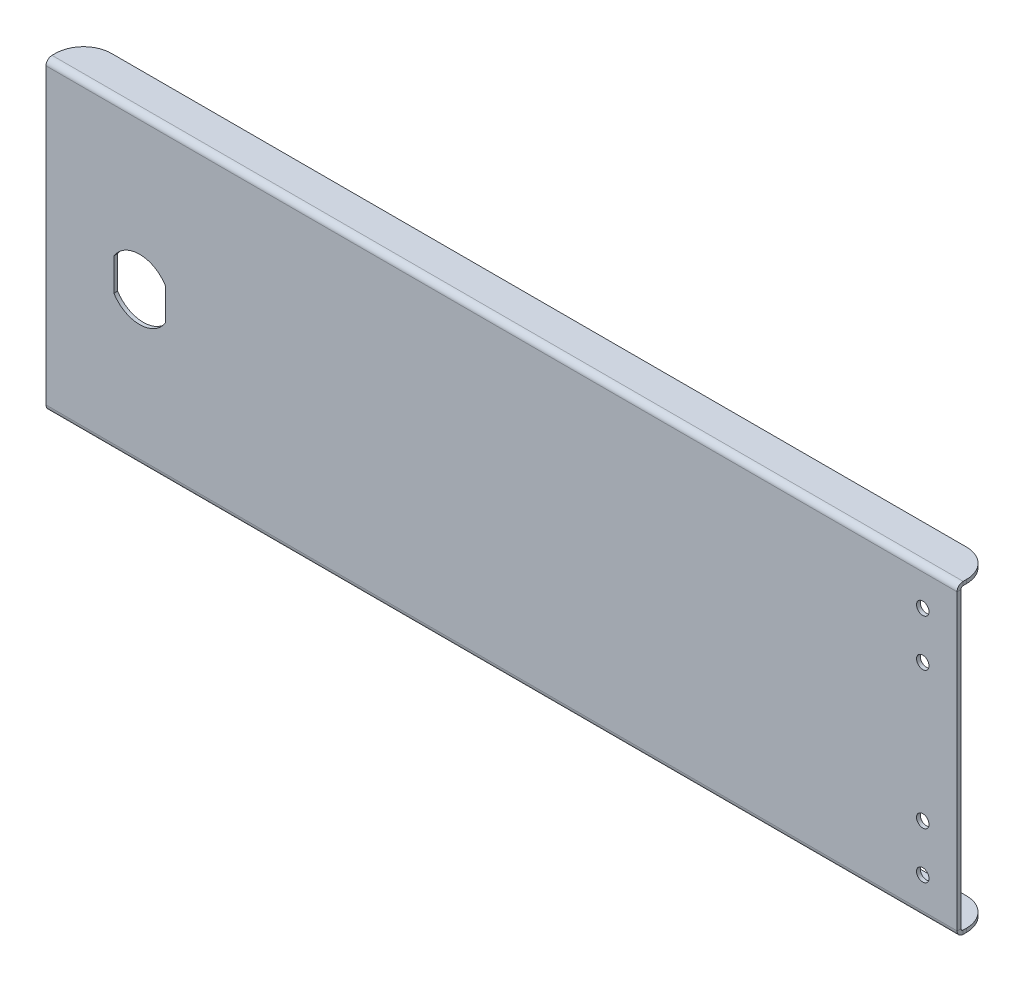
ISO-10303-21;
HEADER;
FILE_DESCRIPTION(('STEP AP214'),'2;1');
FILE_NAME('part.step','',(''),(''),'','','');
FILE_SCHEMA(('AUTOMOTIVE_DESIGN { 1 0 10303 214 1 1 1 1 }'));
ENDSEC;
DATA;
#1=APPLICATION_CONTEXT('core data for automotive mechanical design processes');
#2=APPLICATION_PROTOCOL_DEFINITION('international standard','automotive_design',2000,#1);
#3=PRODUCT_CONTEXT('',#1,'mechanical');
#4=PRODUCT('Part','Part','',(#3));
#5=PRODUCT_RELATED_PRODUCT_CATEGORY('part','',(#4));
#6=PRODUCT_DEFINITION_FORMATION('','',#4);
#7=PRODUCT_DEFINITION_CONTEXT('part definition',#1,'design');
#8=PRODUCT_DEFINITION('design','',#6,#7);
#9=PRODUCT_DEFINITION_SHAPE('','',#8);
#10=(LENGTH_UNIT() NAMED_UNIT(*) SI_UNIT(.MILLI.,.METRE.));
#11=(NAMED_UNIT(*) PLANE_ANGLE_UNIT() SI_UNIT($,.RADIAN.));
#12=(NAMED_UNIT(*) SI_UNIT($,.STERADIAN.) SOLID_ANGLE_UNIT());
#13=UNCERTAINTY_MEASURE_WITH_UNIT(LENGTH_MEASURE(1.E-05),#10,'distance_accuracy_value','');
#14=(GEOMETRIC_REPRESENTATION_CONTEXT(3) GLOBAL_UNCERTAINTY_ASSIGNED_CONTEXT((#13)) GLOBAL_UNIT_ASSIGNED_CONTEXT((#10,
#11,#12)) REPRESENTATION_CONTEXT('',''));
#15=CARTESIAN_POINT('',(0.,0.,0.));
#16=DIRECTION('',(0.,0.,1.));
#17=DIRECTION('',(1.,0.,0.));
#18=AXIS2_PLACEMENT_3D('',#15,#16,#17);
#19=CARTESIAN_POINT('',(0.,98.,3.81974001263783E-13));
#20=DIRECTION('',(0.,-1.,0.));
#21=DIRECTION('',(0.,0.,-1.));
#22=AXIS2_PLACEMENT_3D('',#19,#20,#21);
#23=PLANE('',#22);
#24=CARTESIAN_POINT('',(9.00000000000006,98.,-2.99999999999994));
#25=DIRECTION('',(0.,-1.,0.));
#26=DIRECTION('',(0.,0.,-1.));
#27=AXIS2_PLACEMENT_3D('',#24,#25,#26);
#28=CIRCLE('',#27,9.00000000000006);
#29=CARTESIAN_POINT('',(9.00000000000006,98.,-12.));
#30=VERTEX_POINT('',#29);
#31=CARTESIAN_POINT('',(0.,98.,-3.));
#32=VERTEX_POINT('',#31);
#33=EDGE_CURVE('E96',#30,#32,#28,.F.);
#34=ORIENTED_EDGE('',*,*,#33,.T.);
#35=DIRECTION('',(0.,0.,1.));
#36=VECTOR('',#35,1.);
#37=CARTESIAN_POINT('',(0.,98.,3.81974001263783E-13));
#38=LINE('',#37,#36);
#39=CARTESIAN_POINT('',(0.,98.,-1.93660000000001));
#40=VERTEX_POINT('',#39);
#41=EDGE_CURVE('E289',#32,#40,#38,.T.);
#42=ORIENTED_EDGE('',*,*,#41,.T.);
#43=DIRECTION('',(1.,0.,0.));
#44=VECTOR('',#43,1.);
#45=CARTESIAN_POINT('',(0.,98.,-1.93660000000001));
#46=LINE('',#45,#44);
#47=CARTESIAN_POINT('',(292.,98.,-1.93660000000001));
#48=VERTEX_POINT('',#47);
#49=EDGE_CURVE('E306',#48,#40,#46,.F.);
#50=ORIENTED_EDGE('',*,*,#49,.F.);
#51=DIRECTION('',(0.,0.,-1.));
#52=VECTOR('',#51,1.);
#53=CARTESIAN_POINT('',(292.,98.,3.81974001263783E-13));
#54=LINE('',#53,#52);
#55=CARTESIAN_POINT('',(292.,98.,-2.99999999999999));
#56=VERTEX_POINT('',#55);
#57=EDGE_CURVE('E295',#48,#56,#54,.T.);
#58=ORIENTED_EDGE('',*,*,#57,.T.);
#59=CARTESIAN_POINT('',(283.,98.,-2.99999999999999));
#60=DIRECTION('',(0.,-1.,0.));
#61=DIRECTION('',(0.,0.,-1.));
#62=AXIS2_PLACEMENT_3D('',#59,#60,#61);
#63=CIRCLE('',#62,9.00000000000004);
#64=CARTESIAN_POINT('',(283.,98.,-12.));
#65=VERTEX_POINT('',#64);
#66=EDGE_CURVE('E422',#56,#65,#63,.F.);
#67=ORIENTED_EDGE('',*,*,#66,.T.);
#68=DIRECTION('',(-1.,0.,0.));
#69=VECTOR('',#68,1.);
#70=CARTESIAN_POINT('',(0.,98.,-12.));
#71=LINE('',#70,#69);
#72=EDGE_CURVE('E292',#65,#30,#71,.T.);
#73=ORIENTED_EDGE('',*,*,#72,.T.);
#74=EDGE_LOOP('',(#34,#42,#50,#58,#67,#73));
#75=FACE_BOUND('',#74,.T.);
#76=ADVANCED_FACE('F79',(#75),#23,.F.);
#77=CARTESIAN_POINT('',(0.,96.8,3.77784223657171E-13));
#78=DIRECTION('',(0.,-1.,0.));
#79=DIRECTION('',(0.,0.,-1.));
#80=AXIS2_PLACEMENT_3D('',#77,#78,#79);
#81=PLANE('',#80);
#82=DIRECTION('',(0.,0.,-1.));
#83=VECTOR('',#82,1.);
#84=CARTESIAN_POINT('',(0.,96.8,-1.2));
#85=LINE('',#84,#83);
#86=CARTESIAN_POINT('',(0.,96.8,-3.00000000000001));
#87=VERTEX_POINT('',#86);
#88=CARTESIAN_POINT('',(0.,96.8,-1.93660000000001));
#89=VERTEX_POINT('',#88);
#90=EDGE_CURVE('E298',#87,#89,#85,.F.);
#91=ORIENTED_EDGE('',*,*,#90,.F.);
#92=CARTESIAN_POINT('',(9.00000000000006,96.8,-2.99999999999995));
#93=DIRECTION('',(0.,-1.,0.));
#94=DIRECTION('',(0.,0.,-1.));
#95=AXIS2_PLACEMENT_3D('',#92,#93,#94);
#96=CIRCLE('',#95,9.00000000000006);
#97=CARTESIAN_POINT('',(9.00000000000006,96.8,-12.));
#98=VERTEX_POINT('',#97);
#99=EDGE_CURVE('E440',#98,#87,#96,.F.);
#100=ORIENTED_EDGE('',*,*,#99,.F.);
#101=DIRECTION('',(1.,0.,0.));
#102=VECTOR('',#101,1.);
#103=CARTESIAN_POINT('',(0.,96.8,-12.));
#104=LINE('',#103,#102);
#105=CARTESIAN_POINT('',(283.,96.8,-12.));
#106=VERTEX_POINT('',#105);
#107=EDGE_CURVE('E300',#106,#98,#104,.F.);
#108=ORIENTED_EDGE('',*,*,#107,.F.);
#109=CARTESIAN_POINT('',(283.,96.8,-3.));
#110=DIRECTION('',(0.,-1.,0.));
#111=DIRECTION('',(0.,0.,-1.));
#112=AXIS2_PLACEMENT_3D('',#109,#110,#111);
#113=CIRCLE('',#112,9.00000000000004);
#114=CARTESIAN_POINT('',(292.,96.8,-2.99999999999999));
#115=VERTEX_POINT('',#114);
#116=EDGE_CURVE('E423',#115,#106,#113,.F.);
#117=ORIENTED_EDGE('',*,*,#116,.F.);
#118=DIRECTION('',(0.,0.,1.));
#119=VECTOR('',#118,1.);
#120=CARTESIAN_POINT('',(292.,96.8,-12.));
#121=LINE('',#120,#119);
#122=CARTESIAN_POINT('',(292.,96.8,-1.93660000000001));
#123=VERTEX_POINT('',#122);
#124=EDGE_CURVE('E303',#123,#115,#121,.F.);
#125=ORIENTED_EDGE('',*,*,#124,.F.);
#126=DIRECTION('',(1.,0.,0.));
#127=VECTOR('',#126,1.);
#128=CARTESIAN_POINT('',(0.,96.8,-1.93660000000001));
#129=LINE('',#128,#127);
#130=EDGE_CURVE('E312',#89,#123,#129,.T.);
#131=ORIENTED_EDGE('',*,*,#130,.F.);
#132=EDGE_LOOP('',(#91,#100,#108,#117,#125,#131));
#133=FACE_BOUND('',#132,.T.);
#134=ADVANCED_FACE('F489',(#133),#81,.T.);
#135=CARTESIAN_POINT('',(0.,98.,-12.));
#136=DIRECTION('',(0.,0.,1.));
#137=DIRECTION('',(0.,-1.,0.));
#138=AXIS2_PLACEMENT_3D('',#135,#136,#137);
#139=PLANE('',#138);
#140=DIRECTION('',(0.,-1.,0.));
#141=VECTOR('',#140,1.);
#142=CARTESIAN_POINT('',(9.00000000000006,96.8,-12.));
#143=LINE('',#142,#141);
#144=EDGE_CURVE('E436',#98,#30,#143,.F.);
#145=ORIENTED_EDGE('',*,*,#144,.T.);
#146=ORIENTED_EDGE('',*,*,#72,.F.);
#147=DIRECTION('',(0.,-1.,0.));
#148=VECTOR('',#147,1.);
#149=CARTESIAN_POINT('',(283.,96.8,-12.));
#150=LINE('',#149,#148);
#151=EDGE_CURVE('E268',#106,#65,#150,.F.);
#152=ORIENTED_EDGE('',*,*,#151,.F.);
#153=ORIENTED_EDGE('',*,*,#107,.T.);
#154=EDGE_LOOP('',(#145,#146,#152,#153));
#155=FACE_BOUND('',#154,.T.);
#156=ADVANCED_FACE('F494',(#155),#139,.F.);
#157=CARTESIAN_POINT('',(0.,0.,-12.));
#158=DIRECTION('',(1.,0.,0.));
#159=DIRECTION('',(0.,0.,-1.));
#160=AXIS2_PLACEMENT_3D('',#157,#158,#159);
#161=PLANE('',#160);
#162=DIRECTION('',(0.,1.,0.));
#163=VECTOR('',#162,1.);
#164=CARTESIAN_POINT('',(0.,1.19999999999998,-3.00000000000037));
#165=LINE('',#164,#163);
#166=CARTESIAN_POINT('',(0.,1.19999999999998,-3.00000000000037));
#167=VERTEX_POINT('',#166);
#168=CARTESIAN_POINT('',(0.,0.,-3.00000000000037));
#169=VERTEX_POINT('',#168);
#170=EDGE_CURVE('E429',#167,#169,#165,.F.);
#171=ORIENTED_EDGE('',*,*,#170,.T.);
#172=DIRECTION('',(0.,0.,-1.));
#173=VECTOR('',#172,1.);
#174=CARTESIAN_POINT('',(0.,0.,0.));
#175=LINE('',#174,#173);
#176=CARTESIAN_POINT('',(0.,0.,-1.93659999999999));
#177=VERTEX_POINT('',#176);
#178=EDGE_CURVE('E244',#177,#169,#175,.T.);
#179=ORIENTED_EDGE('',*,*,#178,.F.);
#180=DIRECTION('',(0.,1.,0.));
#181=VECTOR('',#180,1.);
#182=CARTESIAN_POINT('',(0.,1.2,-1.9366));
#183=LINE('',#182,#181);
#184=CARTESIAN_POINT('',(0.,1.19999999999995,-1.9366));
#185=VERTEX_POINT('',#184);
#186=EDGE_CURVE('E262',#185,#177,#183,.F.);
#187=ORIENTED_EDGE('',*,*,#186,.F.);
#188=DIRECTION('',(0.,0.,1.));
#189=VECTOR('',#188,1.);
#190=CARTESIAN_POINT('',(0.,1.19999999999996,-12.));
#191=LINE('',#190,#189);
#192=EDGE_CURVE('E257',#185,#167,#191,.F.);
#193=ORIENTED_EDGE('',*,*,#192,.T.);
#194=EDGE_LOOP('',(#171,#179,#187,#193));
#195=FACE_BOUND('',#194,.T.);
#196=ADVANCED_FACE('F474',(#195),#161,.F.);
#197=CARTESIAN_POINT('',(0.,0.,0.));
#198=DIRECTION('',(0.,1.,0.));
#199=DIRECTION('',(0.,0.,1.));
#200=AXIS2_PLACEMENT_3D('',#197,#198,#199);
#201=PLANE('',#200);
#202=CARTESIAN_POINT('',(283.,0.,-3.00000000000036));
#203=DIRECTION('',(0.,1.,0.));
#204=DIRECTION('',(0.,0.,1.));
#205=AXIS2_PLACEMENT_3D('',#202,#203,#204);
#206=CIRCLE('',#205,9.00000000000004);
#207=CARTESIAN_POINT('',(283.,0.,-12.));
#208=VERTEX_POINT('',#207);
#209=CARTESIAN_POINT('',(292.,0.,-3.00000000000036));
#210=VERTEX_POINT('',#209);
#211=EDGE_CURVE('E104',#208,#210,#206,.F.);
#212=ORIENTED_EDGE('',*,*,#211,.T.);
#213=DIRECTION('',(0.,0.,1.));
#214=VECTOR('',#213,1.);
#215=CARTESIAN_POINT('',(292.,0.,0.));
#216=LINE('',#215,#214);
#217=CARTESIAN_POINT('',(292.,0.,-1.93659999999999));
#218=VERTEX_POINT('',#217);
#219=EDGE_CURVE('E229',#210,#218,#216,.T.);
#220=ORIENTED_EDGE('',*,*,#219,.T.);
#221=DIRECTION('',(-1.,0.,0.));
#222=VECTOR('',#221,1.);
#223=CARTESIAN_POINT('',(292.,0.,-1.93659999999999));
#224=LINE('',#223,#222);
#225=EDGE_CURVE('E260',#177,#218,#224,.F.);
#226=ORIENTED_EDGE('',*,*,#225,.F.);
#227=ORIENTED_EDGE('',*,*,#178,.T.);
#228=CARTESIAN_POINT('',(9.00000000000006,0.,-3.00000000000031));
#229=DIRECTION('',(0.,1.,0.));
#230=DIRECTION('',(0.,0.,1.));
#231=AXIS2_PLACEMENT_3D('',#228,#229,#230);
#232=CIRCLE('',#231,9.00000000000006);
#233=CARTESIAN_POINT('',(9.00000000000006,0.,-12.));
#234=VERTEX_POINT('',#233);
#235=EDGE_CURVE('E432',#169,#234,#232,.F.);
#236=ORIENTED_EDGE('',*,*,#235,.T.);
#237=DIRECTION('',(1.,0.,0.));
#238=VECTOR('',#237,1.);
#239=CARTESIAN_POINT('',(0.,0.,-12.));
#240=LINE('',#239,#238);
#241=EDGE_CURVE('E233',#234,#208,#240,.T.);
#242=ORIENTED_EDGE('',*,*,#241,.T.);
#243=EDGE_LOOP('',(#212,#220,#226,#227,#236,#242));
#244=FACE_BOUND('',#243,.T.);
#245=ADVANCED_FACE('F227',(#244),#201,.F.);
#246=CARTESIAN_POINT('',(0.,1.2,0.));
#247=DIRECTION('',(0.,1.,0.));
#248=DIRECTION('',(0.,0.,1.));
#249=AXIS2_PLACEMENT_3D('',#246,#247,#248);
#250=PLANE('',#249);
#251=DIRECTION('',(0.,0.,-1.));
#252=VECTOR('',#251,1.);
#253=CARTESIAN_POINT('',(292.,1.2,-1.2));
#254=LINE('',#253,#252);
#255=CARTESIAN_POINT('',(292.,1.19999999999998,-3.00000000000037));
#256=VERTEX_POINT('',#255);
#257=CARTESIAN_POINT('',(292.,1.2,-1.9366));
#258=VERTEX_POINT('',#257);
#259=EDGE_CURVE('E252',#256,#258,#254,.F.);
#260=ORIENTED_EDGE('',*,*,#259,.F.);
#261=CARTESIAN_POINT('',(283.,1.19999999999999,-3.00000000000036));
#262=DIRECTION('',(0.,1.,0.));
#263=DIRECTION('',(0.,0.,1.));
#264=AXIS2_PLACEMENT_3D('',#261,#262,#263);
#265=CIRCLE('',#264,9.00000000000004);
#266=CARTESIAN_POINT('',(283.,1.19999999999996,-12.));
#267=VERTEX_POINT('',#266);
#268=EDGE_CURVE('E218',#267,#256,#265,.F.);
#269=ORIENTED_EDGE('',*,*,#268,.F.);
#270=DIRECTION('',(-1.,0.,0.));
#271=VECTOR('',#270,1.);
#272=CARTESIAN_POINT('',(292.,1.19999999999996,-12.));
#273=LINE('',#272,#271);
#274=CARTESIAN_POINT('',(9.00000000000006,1.19999999999996,-12.));
#275=VERTEX_POINT('',#274);
#276=EDGE_CURVE('E254',#275,#267,#273,.F.);
#277=ORIENTED_EDGE('',*,*,#276,.F.);
#278=CARTESIAN_POINT('',(9.00000000000006,1.19999999999999,-3.00000000000032));
#279=DIRECTION('',(0.,1.,0.));
#280=DIRECTION('',(0.,0.,1.));
#281=AXIS2_PLACEMENT_3D('',#278,#279,#280);
#282=CIRCLE('',#281,9.00000000000006);
#283=EDGE_CURVE('E222',#167,#275,#282,.F.);
#284=ORIENTED_EDGE('',*,*,#283,.F.);
#285=ORIENTED_EDGE('',*,*,#192,.F.);
#286=DIRECTION('',(-1.,0.,0.));
#287=VECTOR('',#286,1.);
#288=CARTESIAN_POINT('',(292.,1.2,-1.9366));
#289=LINE('',#288,#287);
#290=EDGE_CURVE('E265',#258,#185,#289,.T.);
#291=ORIENTED_EDGE('',*,*,#290,.F.);
#292=EDGE_LOOP('',(#260,#269,#277,#284,#285,#291));
#293=FACE_BOUND('',#292,.T.);
#294=ADVANCED_FACE('F449',(#293),#250,.T.);
#295=CARTESIAN_POINT('',(292.,0.,-12.));
#296=DIRECTION('',(0.,0.,1.));
#297=DIRECTION('',(0.,-1.,0.));
#298=AXIS2_PLACEMENT_3D('',#295,#296,#297);
#299=PLANE('',#298);
#300=DIRECTION('',(0.,1.,0.));
#301=VECTOR('',#300,1.);
#302=CARTESIAN_POINT('',(283.,1.19999999999996,-12.));
#303=LINE('',#302,#301);
#304=EDGE_CURVE('E223',#267,#208,#303,.F.);
#305=ORIENTED_EDGE('',*,*,#304,.T.);
#306=ORIENTED_EDGE('',*,*,#241,.F.);
#307=DIRECTION('',(0.,1.,0.));
#308=VECTOR('',#307,1.);
#309=CARTESIAN_POINT('',(9.00000000000006,1.19999999999996,-12.));
#310=LINE('',#309,#308);
#311=EDGE_CURVE('E426',#275,#234,#310,.F.);
#312=ORIENTED_EDGE('',*,*,#311,.F.);
#313=ORIENTED_EDGE('',*,*,#276,.T.);
#314=EDGE_LOOP('',(#305,#306,#312,#313));
#315=FACE_BOUND('',#314,.T.);
#316=ADVANCED_FACE('F445',(#315),#299,.F.);
#317=CARTESIAN_POINT('',(292.,98.,-12.));
#318=DIRECTION('',(-1.,0.,0.));
#319=DIRECTION('',(0.,0.,1.));
#320=AXIS2_PLACEMENT_3D('',#317,#318,#319);
#321=PLANE('',#320);
#322=DIRECTION('',(0.,-1.,0.));
#323=VECTOR('',#322,1.);
#324=CARTESIAN_POINT('',(292.,96.8,-2.99999999999999));
#325=LINE('',#324,#323);
#326=EDGE_CURVE('E247',#115,#56,#325,.F.);
#327=ORIENTED_EDGE('',*,*,#326,.T.);
#328=ORIENTED_EDGE('',*,*,#57,.F.);
#329=DIRECTION('',(0.,-1.,0.));
#330=VECTOR('',#329,1.);
#331=CARTESIAN_POINT('',(292.,96.8,-1.93660000000001));
#332=LINE('',#331,#330);
#333=EDGE_CURVE('E309',#123,#48,#332,.F.);
#334=ORIENTED_EDGE('',*,*,#333,.F.);
#335=ORIENTED_EDGE('',*,*,#124,.T.);
#336=EDGE_LOOP('',(#327,#328,#334,#335));
#337=FACE_BOUND('',#336,.T.);
#338=ADVANCED_FACE('F419',(#337),#321,.F.);
#339=CARTESIAN_POINT('',(0.,0.,-1.2));
#340=DIRECTION('',(0.,0.,-1.));
#341=DIRECTION('',(-1.,0.,0.));
#342=AXIS2_PLACEMENT_3D('',#339,#340,#341);
#343=PLANE('',#342);
#344=CARTESIAN_POINT('',(30.,49.,-1.2));
#345=DIRECTION('',(0.,0.,1.));
#346=DIRECTION('',(1.,0.,0.));
#347=AXIS2_PLACEMENT_3D('',#344,#345,#346);
#348=CIRCLE('',#347,9.75);
#349=CARTESIAN_POINT('',(38.25,54.1961524227066,-1.2));
#350=VERTEX_POINT('',#349);
#351=CARTESIAN_POINT('',(21.75,54.1961524227066,-1.2));
#352=VERTEX_POINT('',#351);
#353=EDGE_CURVE('E338',#350,#352,#348,.T.);
#354=ORIENTED_EDGE('',*,*,#353,.T.);
#355=DIRECTION('',(0.,-1.,0.));
#356=VECTOR('',#355,1.);
#357=CARTESIAN_POINT('',(21.75,54.1961524227066,-1.2));
#358=LINE('',#357,#356);
#359=CARTESIAN_POINT('',(21.75,43.8038475772934,-1.2));
#360=VERTEX_POINT('',#359);
#361=EDGE_CURVE('E341',#352,#360,#358,.T.);
#362=ORIENTED_EDGE('',*,*,#361,.T.);
#363=CARTESIAN_POINT('',(30.,49.,-1.2));
#364=DIRECTION('',(0.,0.,1.));
#365=DIRECTION('',(1.,0.,0.));
#366=AXIS2_PLACEMENT_3D('',#363,#364,#365);
#367=CIRCLE('',#366,9.75);
#368=CARTESIAN_POINT('',(38.25,43.8038475772934,-1.2));
#369=VERTEX_POINT('',#368);
#370=EDGE_CURVE('E345',#360,#369,#367,.T.);
#371=ORIENTED_EDGE('',*,*,#370,.T.);
#372=DIRECTION('',(0.,1.,0.));
#373=VECTOR('',#372,1.);
#374=CARTESIAN_POINT('',(38.25,54.1961524227066,-1.2));
#375=LINE('',#374,#373);
#376=EDGE_CURVE('E348',#369,#350,#375,.T.);
#377=ORIENTED_EDGE('',*,*,#376,.T.);
#378=EDGE_LOOP('',(#354,#362,#371,#377));
#379=FACE_BOUND('',#378,.T.);
#380=CARTESIAN_POINT('',(281.,12.,-1.2));
#381=DIRECTION('',(0.,0.,1.));
#382=DIRECTION('',(1.,0.,0.));
#383=AXIS2_PLACEMENT_3D('',#380,#381,#382);
#384=CIRCLE('',#383,2.);
#385=CARTESIAN_POINT('',(283.,12.,-1.2));
#386=VERTEX_POINT('',#385);
#387=EDGE_CURVE('E370',#386,#386,#384,.T.);
#388=ORIENTED_EDGE('',*,*,#387,.T.);
#389=EDGE_LOOP('',(#388));
#390=FACE_BOUND('',#389,.T.);
#391=CARTESIAN_POINT('',(281.,27.,-1.2));
#392=DIRECTION('',(0.,0.,1.));
#393=DIRECTION('',(1.,0.,0.));
#394=AXIS2_PLACEMENT_3D('',#391,#392,#393);
#395=CIRCLE('',#394,2.);
#396=CARTESIAN_POINT('',(283.,27.,-1.2));
#397=VERTEX_POINT('',#396);
#398=EDGE_CURVE('E376',#397,#397,#395,.T.);
#399=ORIENTED_EDGE('',*,*,#398,.T.);
#400=EDGE_LOOP('',(#399));
#401=FACE_BOUND('',#400,.T.);
#402=CARTESIAN_POINT('',(281.,71.,-1.2));
#403=DIRECTION('',(0.,0.,1.));
#404=DIRECTION('',(1.,0.,0.));
#405=AXIS2_PLACEMENT_3D('',#402,#403,#404);
#406=CIRCLE('',#405,2.);
#407=CARTESIAN_POINT('',(283.,71.,-1.2));
#408=VERTEX_POINT('',#407);
#409=EDGE_CURVE('E382',#408,#408,#406,.T.);
#410=ORIENTED_EDGE('',*,*,#409,.T.);
#411=EDGE_LOOP('',(#410));
#412=FACE_BOUND('',#411,.T.);
#413=CARTESIAN_POINT('',(281.,86.,-1.2));
#414=DIRECTION('',(0.,0.,1.));
#415=DIRECTION('',(1.,0.,0.));
#416=AXIS2_PLACEMENT_3D('',#413,#414,#415);
#417=CIRCLE('',#416,2.);
#418=CARTESIAN_POINT('',(283.,86.,-1.2));
#419=VERTEX_POINT('',#418);
#420=EDGE_CURVE('E388',#419,#419,#417,.T.);
#421=ORIENTED_EDGE('',*,*,#420,.T.);
#422=EDGE_LOOP('',(#421));
#423=FACE_BOUND('',#422,.T.);
#424=DIRECTION('',(0.,1.,0.));
#425=VECTOR('',#424,1.);
#426=CARTESIAN_POINT('',(292.,0.,-1.2));
#427=LINE('',#426,#425);
#428=CARTESIAN_POINT('',(292.,1.93660000000004,-1.19999999999998));
#429=VERTEX_POINT('',#428);
#430=CARTESIAN_POINT('',(292.,96.0634,-1.2));
#431=VERTEX_POINT('',#430);
#432=EDGE_CURVE('E13',#429,#431,#427,.T.);
#433=ORIENTED_EDGE('',*,*,#432,.F.);
#434=DIRECTION('',(-1.,0.,0.));
#435=VECTOR('',#434,1.);
#436=CARTESIAN_POINT('',(0.,1.9366,-1.19999999999998));
#437=LINE('',#436,#435);
#438=CARTESIAN_POINT('',(0.,1.9366,-1.19999999999998));
#439=VERTEX_POINT('',#438);
#440=EDGE_CURVE('E242',#439,#429,#437,.F.);
#441=ORIENTED_EDGE('',*,*,#440,.F.);
#442=DIRECTION('',(0.,-1.,0.));
#443=VECTOR('',#442,1.);
#444=CARTESIAN_POINT('',(0.,0.,-1.2));
#445=LINE('',#444,#443);
#446=CARTESIAN_POINT('',(0.,96.0634,-1.2));
#447=VERTEX_POINT('',#446);
#448=EDGE_CURVE('E88',#447,#439,#445,.T.);
#449=ORIENTED_EDGE('',*,*,#448,.F.);
#450=DIRECTION('',(1.,0.,0.));
#451=VECTOR('',#450,1.);
#452=CARTESIAN_POINT('',(292.,96.0634,-1.20000000000001));
#453=LINE('',#452,#451);
#454=EDGE_CURVE('E328',#431,#447,#453,.F.);
#455=ORIENTED_EDGE('',*,*,#454,.F.);
#456=EDGE_LOOP('',(#433,#441,#449,#455));
#457=FACE_BOUND('',#456,.T.);
#458=ADVANCED_FACE('F463',(#379,#390,#401,#412,#423,#457),#343,.T.);
#459=CARTESIAN_POINT('',(0.,0.,0.));
#460=DIRECTION('',(0.,0.,-1.));
#461=DIRECTION('',(-1.,0.,0.));
#462=AXIS2_PLACEMENT_3D('',#459,#460,#461);
#463=PLANE('',#462);
#464=DIRECTION('',(0.,-1.,0.));
#465=VECTOR('',#464,1.);
#466=CARTESIAN_POINT('',(21.75,54.1961524227066,0.));
#467=LINE('',#466,#465);
#468=CARTESIAN_POINT('',(21.75,54.1961524227066,0.));
#469=VERTEX_POINT('',#468);
#470=CARTESIAN_POINT('',(21.75,43.8038475772934,0.));
#471=VERTEX_POINT('',#470);
#472=EDGE_CURVE('E353',#469,#471,#467,.T.);
#473=ORIENTED_EDGE('',*,*,#472,.F.);
#474=CARTESIAN_POINT('',(30.,49.,0.));
#475=DIRECTION('',(0.,0.,1.));
#476=DIRECTION('',(1.,0.,0.));
#477=AXIS2_PLACEMENT_3D('',#474,#475,#476);
#478=CIRCLE('',#477,9.75);
#479=CARTESIAN_POINT('',(38.25,54.1961524227066,0.));
#480=VERTEX_POINT('',#479);
#481=EDGE_CURVE('E336',#480,#469,#478,.T.);
#482=ORIENTED_EDGE('',*,*,#481,.F.);
#483=DIRECTION('',(0.,1.,0.));
#484=VECTOR('',#483,1.);
#485=CARTESIAN_POINT('',(38.25,54.1961524227066,0.));
#486=LINE('',#485,#484);
#487=CARTESIAN_POINT('',(38.25,43.8038475772934,0.));
#488=VERTEX_POINT('',#487);
#489=EDGE_CURVE('E342',#488,#480,#486,.T.);
#490=ORIENTED_EDGE('',*,*,#489,.F.);
#491=CARTESIAN_POINT('',(30.,49.,0.));
#492=DIRECTION('',(0.,0.,1.));
#493=DIRECTION('',(1.,0.,0.));
#494=AXIS2_PLACEMENT_3D('',#491,#492,#493);
#495=CIRCLE('',#494,9.75);
#496=EDGE_CURVE('E356',#471,#488,#495,.T.);
#497=ORIENTED_EDGE('',*,*,#496,.F.);
#498=EDGE_LOOP('',(#473,#482,#490,#497));
#499=FACE_BOUND('',#498,.T.);
#500=CARTESIAN_POINT('',(281.,12.,0.));
#501=DIRECTION('',(0.,0.,1.));
#502=DIRECTION('',(1.,0.,0.));
#503=AXIS2_PLACEMENT_3D('',#500,#501,#502);
#504=CIRCLE('',#503,2.);
#505=CARTESIAN_POINT('',(283.,12.,0.));
#506=VERTEX_POINT('',#505);
#507=EDGE_CURVE('E363',#506,#506,#504,.T.);
#508=ORIENTED_EDGE('',*,*,#507,.F.);
#509=EDGE_LOOP('',(#508));
#510=FACE_BOUND('',#509,.T.);
#511=CARTESIAN_POINT('',(281.,27.,0.));
#512=DIRECTION('',(0.,0.,1.));
#513=DIRECTION('',(1.,0.,0.));
#514=AXIS2_PLACEMENT_3D('',#511,#512,#513);
#515=CIRCLE('',#514,2.);
#516=CARTESIAN_POINT('',(283.,27.,0.));
#517=VERTEX_POINT('',#516);
#518=EDGE_CURVE('E373',#517,#517,#515,.T.);
#519=ORIENTED_EDGE('',*,*,#518,.F.);
#520=EDGE_LOOP('',(#519));
#521=FACE_BOUND('',#520,.T.);
#522=CARTESIAN_POINT('',(281.,71.,0.));
#523=DIRECTION('',(0.,0.,1.));
#524=DIRECTION('',(1.,0.,0.));
#525=AXIS2_PLACEMENT_3D('',#522,#523,#524);
#526=CIRCLE('',#525,2.);
#527=CARTESIAN_POINT('',(283.,71.,0.));
#528=VERTEX_POINT('',#527);
#529=EDGE_CURVE('E379',#528,#528,#526,.T.);
#530=ORIENTED_EDGE('',*,*,#529,.F.);
#531=EDGE_LOOP('',(#530));
#532=FACE_BOUND('',#531,.T.);
#533=CARTESIAN_POINT('',(281.,86.,0.));
#534=DIRECTION('',(0.,0.,1.));
#535=DIRECTION('',(1.,0.,0.));
#536=AXIS2_PLACEMENT_3D('',#533,#534,#535);
#537=CIRCLE('',#536,2.);
#538=CARTESIAN_POINT('',(283.,86.,0.));
#539=VERTEX_POINT('',#538);
#540=EDGE_CURVE('E385',#539,#539,#537,.T.);
#541=ORIENTED_EDGE('',*,*,#540,.F.);
#542=EDGE_LOOP('',(#541));
#543=FACE_BOUND('',#542,.T.);
#544=DIRECTION('',(-1.,0.,0.));
#545=VECTOR('',#544,1.);
#546=CARTESIAN_POINT('',(0.,1.93660000000003,0.));
#547=LINE('',#546,#545);
#548=CARTESIAN_POINT('',(0.,1.93660000000003,0.));
#549=VERTEX_POINT('',#548);
#550=CARTESIAN_POINT('',(292.,1.93660000000004,0.));
#551=VERTEX_POINT('',#550);
#552=EDGE_CURVE('E269',#549,#551,#547,.F.);
#553=ORIENTED_EDGE('',*,*,#552,.T.);
#554=DIRECTION('',(0.,1.,0.));
#555=VECTOR('',#554,1.);
#556=CARTESIAN_POINT('',(292.,0.,0.));
#557=LINE('',#556,#555);
#558=CARTESIAN_POINT('',(292.,96.0634,0.));
#559=VERTEX_POINT('',#558);
#560=EDGE_CURVE('E83',#551,#559,#557,.T.);
#561=ORIENTED_EDGE('',*,*,#560,.T.);
#562=DIRECTION('',(1.,0.,0.));
#563=VECTOR('',#562,1.);
#564=CARTESIAN_POINT('',(292.,96.0634,0.));
#565=LINE('',#564,#563);
#566=CARTESIAN_POINT('',(0.,96.0634,0.));
#567=VERTEX_POINT('',#566);
#568=EDGE_CURVE('E316',#559,#567,#565,.F.);
#569=ORIENTED_EDGE('',*,*,#568,.T.);
#570=DIRECTION('',(0.,-1.,0.));
#571=VECTOR('',#570,1.);
#572=CARTESIAN_POINT('',(0.,0.,0.));
#573=LINE('',#572,#571);
#574=EDGE_CURVE('E391',#567,#549,#573,.T.);
#575=ORIENTED_EDGE('',*,*,#574,.T.);
#576=EDGE_LOOP('',(#553,#561,#569,#575));
#577=FACE_BOUND('',#576,.T.);
#578=ADVANCED_FACE('F400',(#499,#510,#521,#532,#543,#577),#463,.F.);
#579=CARTESIAN_POINT('',(0.,0.,-1.2));
#580=DIRECTION('',(-1.,0.,0.));
#581=DIRECTION('',(0.,0.,1.));
#582=AXIS2_PLACEMENT_3D('',#579,#580,#581);
#583=PLANE('',#582);
#584=ORIENTED_EDGE('',*,*,#448,.T.);
#585=DIRECTION('',(0.,0.,1.));
#586=VECTOR('',#585,1.);
#587=CARTESIAN_POINT('',(0.,1.9366,-1.19999999999998));
#588=LINE('',#587,#586);
#589=EDGE_CURVE('E275',#439,#549,#588,.T.);
#590=ORIENTED_EDGE('',*,*,#589,.T.);
#591=ORIENTED_EDGE('',*,*,#574,.F.);
#592=DIRECTION('',(0.,0.,1.));
#593=VECTOR('',#592,1.);
#594=CARTESIAN_POINT('',(0.,96.0634,-1.20000000000001));
#595=LINE('',#594,#593);
#596=EDGE_CURVE('E333',#447,#567,#595,.T.);
#597=ORIENTED_EDGE('',*,*,#596,.F.);
#598=EDGE_LOOP('',(#584,#590,#591,#597));
#599=FACE_BOUND('',#598,.T.);
#600=ADVANCED_FACE('F81',(#599),#583,.T.);
#601=CARTESIAN_POINT('',(292.,0.,-1.2));
#602=DIRECTION('',(1.,0.,0.));
#603=DIRECTION('',(0.,0.,-1.));
#604=AXIS2_PLACEMENT_3D('',#601,#602,#603);
#605=PLANE('',#604);
#606=DIRECTION('',(0.,0.,1.));
#607=VECTOR('',#606,1.);
#608=CARTESIAN_POINT('',(292.,1.93660000000004,-1.19999999999998));
#609=LINE('',#608,#607);
#610=EDGE_CURVE('E283',#429,#551,#609,.T.);
#611=ORIENTED_EDGE('',*,*,#610,.F.);
#612=ORIENTED_EDGE('',*,*,#432,.T.);
#613=DIRECTION('',(0.,0.,1.));
#614=VECTOR('',#613,1.);
#615=CARTESIAN_POINT('',(292.,96.0634,-1.20000000000001));
#616=LINE('',#615,#614);
#617=EDGE_CURVE('E322',#431,#559,#616,.T.);
#618=ORIENTED_EDGE('',*,*,#617,.T.);
#619=ORIENTED_EDGE('',*,*,#560,.F.);
#620=EDGE_LOOP('',(#611,#612,#618,#619));
#621=FACE_BOUND('',#620,.T.);
#622=ADVANCED_FACE('F552',(#621),#605,.T.);
#623=CARTESIAN_POINT('',(281.,86.,-1.2));
#624=DIRECTION('',(0.,0.,1.));
#625=DIRECTION('',(1.,0.,0.));
#626=AXIS2_PLACEMENT_3D('',#623,#624,#625);
#627=CYLINDRICAL_SURFACE('',#626,2.);
#628=ORIENTED_EDGE('',*,*,#420,.F.);
#629=EDGE_LOOP('',(#628));
#630=FACE_BOUND('',#629,.T.);
#631=ORIENTED_EDGE('',*,*,#540,.T.);
#632=EDGE_LOOP('',(#631));
#633=FACE_BOUND('',#632,.T.);
#634=ADVANCED_FACE('F548',(#630,#633),#627,.F.);
#635=CARTESIAN_POINT('',(281.,71.,-1.2));
#636=DIRECTION('',(0.,0.,1.));
#637=DIRECTION('',(1.,0.,0.));
#638=AXIS2_PLACEMENT_3D('',#635,#636,#637);
#639=CYLINDRICAL_SURFACE('',#638,2.);
#640=ORIENTED_EDGE('',*,*,#409,.F.);
#641=EDGE_LOOP('',(#640));
#642=FACE_BOUND('',#641,.T.);
#643=ORIENTED_EDGE('',*,*,#529,.T.);
#644=EDGE_LOOP('',(#643));
#645=FACE_BOUND('',#644,.T.);
#646=ADVANCED_FACE('F544',(#642,#645),#639,.F.);
#647=CARTESIAN_POINT('',(281.,27.,-1.2));
#648=DIRECTION('',(0.,0.,1.));
#649=DIRECTION('',(1.,0.,0.));
#650=AXIS2_PLACEMENT_3D('',#647,#648,#649);
#651=CYLINDRICAL_SURFACE('',#650,2.);
#652=ORIENTED_EDGE('',*,*,#398,.F.);
#653=EDGE_LOOP('',(#652));
#654=FACE_BOUND('',#653,.T.);
#655=ORIENTED_EDGE('',*,*,#518,.T.);
#656=EDGE_LOOP('',(#655));
#657=FACE_BOUND('',#656,.T.);
#658=ADVANCED_FACE('F540',(#654,#657),#651,.F.);
#659=CARTESIAN_POINT('',(281.,12.,-1.2));
#660=DIRECTION('',(0.,0.,1.));
#661=DIRECTION('',(1.,0.,0.));
#662=AXIS2_PLACEMENT_3D('',#659,#660,#661);
#663=CYLINDRICAL_SURFACE('',#662,2.);
#664=ORIENTED_EDGE('',*,*,#387,.F.);
#665=EDGE_LOOP('',(#664));
#666=FACE_BOUND('',#665,.T.);
#667=ORIENTED_EDGE('',*,*,#507,.T.);
#668=EDGE_LOOP('',(#667));
#669=FACE_BOUND('',#668,.T.);
#670=ADVANCED_FACE('F536',(#666,#669),#663,.F.);
#671=CARTESIAN_POINT('',(30.,49.,-1.2));
#672=DIRECTION('',(0.,0.,1.));
#673=DIRECTION('',(1.,0.,0.));
#674=AXIS2_PLACEMENT_3D('',#671,#672,#673);
#675=CYLINDRICAL_SURFACE('',#674,9.75);
#676=ORIENTED_EDGE('',*,*,#481,.T.);
#677=DIRECTION('',(0.,0.,1.));
#678=VECTOR('',#677,1.);
#679=CARTESIAN_POINT('',(21.75,54.1961524227066,-1.2));
#680=LINE('',#679,#678);
#681=EDGE_CURVE('E351',#352,#469,#680,.T.);
#682=ORIENTED_EDGE('',*,*,#681,.F.);
#683=ORIENTED_EDGE('',*,*,#353,.F.);
#684=DIRECTION('',(0.,0.,1.));
#685=VECTOR('',#684,1.);
#686=CARTESIAN_POINT('',(38.25,54.1961524227066,-1.2));
#687=LINE('',#686,#685);
#688=EDGE_CURVE('E361',#350,#480,#687,.T.);
#689=ORIENTED_EDGE('',*,*,#688,.T.);
#690=EDGE_LOOP('',(#676,#682,#683,#689));
#691=FACE_BOUND('',#690,.T.);
#692=ADVANCED_FACE('F526',(#691),#675,.F.);
#693=CARTESIAN_POINT('',(38.25,54.1961524227066,-1.2));
#694=DIRECTION('',(1.,0.,0.));
#695=DIRECTION('',(0.,0.,-1.));
#696=AXIS2_PLACEMENT_3D('',#693,#694,#695);
#697=PLANE('',#696);
#698=ORIENTED_EDGE('',*,*,#489,.T.);
#699=ORIENTED_EDGE('',*,*,#688,.F.);
#700=ORIENTED_EDGE('',*,*,#376,.F.);
#701=DIRECTION('',(0.,0.,1.));
#702=VECTOR('',#701,1.);
#703=CARTESIAN_POINT('',(38.25,43.8038475772934,-1.2));
#704=LINE('',#703,#702);
#705=EDGE_CURVE('E364',#369,#488,#704,.T.);
#706=ORIENTED_EDGE('',*,*,#705,.T.);
#707=EDGE_LOOP('',(#698,#699,#700,#706));
#708=FACE_BOUND('',#707,.T.);
#709=ADVANCED_FACE('F522',(#708),#697,.F.);
#710=CARTESIAN_POINT('',(30.,49.,-1.2));
#711=DIRECTION('',(0.,0.,1.));
#712=DIRECTION('',(1.,0.,0.));
#713=AXIS2_PLACEMENT_3D('',#710,#711,#712);
#714=CYLINDRICAL_SURFACE('',#713,9.75);
#715=ORIENTED_EDGE('',*,*,#496,.T.);
#716=ORIENTED_EDGE('',*,*,#705,.F.);
#717=ORIENTED_EDGE('',*,*,#370,.F.);
#718=DIRECTION('',(0.,0.,1.));
#719=VECTOR('',#718,1.);
#720=CARTESIAN_POINT('',(21.75,43.8038475772934,-1.2));
#721=LINE('',#720,#719);
#722=EDGE_CURVE('E366',#360,#471,#721,.T.);
#723=ORIENTED_EDGE('',*,*,#722,.T.);
#724=EDGE_LOOP('',(#715,#716,#717,#723));
#725=FACE_BOUND('',#724,.T.);
#726=ADVANCED_FACE('F525',(#725),#714,.F.);
#727=CARTESIAN_POINT('',(21.75,54.1961524227066,-1.2));
#728=DIRECTION('',(-1.,0.,0.));
#729=DIRECTION('',(0.,0.,1.));
#730=AXIS2_PLACEMENT_3D('',#727,#728,#729);
#731=PLANE('',#730);
#732=ORIENTED_EDGE('',*,*,#472,.T.);
#733=ORIENTED_EDGE('',*,*,#722,.F.);
#734=ORIENTED_EDGE('',*,*,#361,.F.);
#735=ORIENTED_EDGE('',*,*,#681,.T.);
#736=EDGE_LOOP('',(#732,#733,#734,#735));
#737=FACE_BOUND('',#736,.T.);
#738=ADVANCED_FACE('F518',(#737),#731,.F.);
#739=CARTESIAN_POINT('',(0.,96.0634,-1.93660000000001));
#740=DIRECTION('',(-1.,0.,0.));
#741=DIRECTION('',(0.,0.,1.));
#742=AXIS2_PLACEMENT_3D('',#739,#740,#741);
#743=PLANE('',#742);
#744=DIRECTION('',(0.,-1.,0.));
#745=VECTOR('',#744,1.);
#746=CARTESIAN_POINT('',(0.,98.,-1.93660000000001));
#747=LINE('',#746,#745);
#748=EDGE_CURVE('E286',#89,#40,#747,.F.);
#749=ORIENTED_EDGE('',*,*,#748,.F.);
#750=CARTESIAN_POINT('',(0.,96.0634,-1.93660000000001));
#751=DIRECTION('',(1.,0.,0.));
#752=DIRECTION('',(0.,0.,-1.));
#753=AXIS2_PLACEMENT_3D('',#750,#751,#752);
#754=CIRCLE('',#753,0.736600000000004);
#755=EDGE_CURVE('E325',#447,#89,#754,.F.);
#756=ORIENTED_EDGE('',*,*,#755,.F.);
#757=ORIENTED_EDGE('',*,*,#596,.T.);
#758=CARTESIAN_POINT('',(0.,96.0634,-1.93660000000001));
#759=DIRECTION('',(1.,0.,0.));
#760=DIRECTION('',(0.,0.,-1.));
#761=AXIS2_PLACEMENT_3D('',#758,#759,#760);
#762=CIRCLE('',#761,1.9366);
#763=EDGE_CURVE('E318',#567,#40,#762,.F.);
#764=ORIENTED_EDGE('',*,*,#763,.T.);
#765=EDGE_LOOP('',(#749,#756,#757,#764));
#766=FACE_BOUND('',#765,.T.);
#767=ADVANCED_FACE('F515',(#766),#743,.T.);
#768=CARTESIAN_POINT('',(292.,96.0634,-1.93660000000001));
#769=DIRECTION('',(-1.,0.,0.));
#770=DIRECTION('',(0.,0.,1.));
#771=AXIS2_PLACEMENT_3D('',#768,#769,#770);
#772=PLANE('',#771);
#773=CARTESIAN_POINT('',(292.,96.0634,-1.93660000000001));
#774=DIRECTION('',(1.,0.,0.));
#775=DIRECTION('',(0.,0.,-1.));
#776=AXIS2_PLACEMENT_3D('',#773,#774,#775);
#777=CIRCLE('',#776,0.736600000000004);
#778=EDGE_CURVE('E291',#123,#431,#777,.T.);
#779=ORIENTED_EDGE('',*,*,#778,.F.);
#780=ORIENTED_EDGE('',*,*,#333,.T.);
#781=CARTESIAN_POINT('',(292.,96.0634,-1.93660000000001));
#782=DIRECTION('',(1.,0.,0.));
#783=DIRECTION('',(0.,0.,-1.));
#784=AXIS2_PLACEMENT_3D('',#781,#782,#783);
#785=CIRCLE('',#784,1.9366);
#786=EDGE_CURVE('E319',#48,#559,#785,.T.);
#787=ORIENTED_EDGE('',*,*,#786,.T.);
#788=ORIENTED_EDGE('',*,*,#617,.F.);
#789=EDGE_LOOP('',(#779,#780,#787,#788));
#790=FACE_BOUND('',#789,.T.);
#791=ADVANCED_FACE('F409',(#790),#772,.F.);
#792=CARTESIAN_POINT('',(292.,96.0634,-1.93660000000001));
#793=DIRECTION('',(1.,0.,0.));
#794=DIRECTION('',(0.,1.,0.));
#795=AXIS2_PLACEMENT_3D('',#792,#793,#794);
#796=CYLINDRICAL_SURFACE('',#795,1.9366);
#797=ORIENTED_EDGE('',*,*,#568,.F.);
#798=ORIENTED_EDGE('',*,*,#786,.F.);
#799=ORIENTED_EDGE('',*,*,#49,.T.);
#800=ORIENTED_EDGE('',*,*,#763,.F.);
#801=EDGE_LOOP('',(#797,#798,#799,#800));
#802=FACE_BOUND('',#801,.T.);
#803=ADVANCED_FACE('F405',(#802),#796,.T.);
#804=CARTESIAN_POINT('',(292.,96.0634,-1.93660000000001));
#805=DIRECTION('',(1.,0.,0.));
#806=DIRECTION('',(0.,1.,0.));
#807=AXIS2_PLACEMENT_3D('',#804,#805,#806);
#808=CYLINDRICAL_SURFACE('',#807,0.736600000000004);
#809=ORIENTED_EDGE('',*,*,#454,.T.);
#810=ORIENTED_EDGE('',*,*,#755,.T.);
#811=ORIENTED_EDGE('',*,*,#130,.T.);
#812=ORIENTED_EDGE('',*,*,#778,.T.);
#813=EDGE_LOOP('',(#809,#810,#811,#812));
#814=FACE_BOUND('',#813,.T.);
#815=ADVANCED_FACE('F503',(#814),#808,.F.);
#816=CARTESIAN_POINT('',(0.,98.,-1.2));
#817=DIRECTION('',(1.,0.,0.));
#818=DIRECTION('',(0.,0.,-1.));
#819=AXIS2_PLACEMENT_3D('',#816,#817,#818);
#820=PLANE('',#819);
#821=ORIENTED_EDGE('',*,*,#41,.F.);
#822=DIRECTION('',(0.,-1.,0.));
#823=VECTOR('',#822,1.);
#824=CARTESIAN_POINT('',(0.,96.8,-3.00000000000001));
#825=LINE('',#824,#823);
#826=EDGE_CURVE('E438',#87,#32,#825,.F.);
#827=ORIENTED_EDGE('',*,*,#826,.F.);
#828=ORIENTED_EDGE('',*,*,#90,.T.);
#829=ORIENTED_EDGE('',*,*,#748,.T.);
#830=EDGE_LOOP('',(#821,#827,#828,#829));
#831=FACE_BOUND('',#830,.T.);
#832=ADVANCED_FACE('F500',(#831),#820,.F.);
#833=CARTESIAN_POINT('',(292.,1.93660000000002,-1.9366));
#834=DIRECTION('',(1.,0.,0.));
#835=DIRECTION('',(0.,1.,0.));
#836=AXIS2_PLACEMENT_3D('',#833,#834,#835);
#837=PLANE('',#836);
#838=DIRECTION('',(0.,1.,0.));
#839=VECTOR('',#838,1.);
#840=CARTESIAN_POINT('',(292.,0.,-1.93659999999999));
#841=LINE('',#840,#839);
#842=EDGE_CURVE('E238',#258,#218,#841,.F.);
#843=ORIENTED_EDGE('',*,*,#842,.F.);
#844=CARTESIAN_POINT('',(292.,1.93660000000002,-1.9366));
#845=DIRECTION('',(-1.,0.,0.));
#846=DIRECTION('',(0.,-1.,0.));
#847=AXIS2_PLACEMENT_3D('',#844,#845,#846);
#848=CIRCLE('',#847,0.736600000000021);
#849=EDGE_CURVE('E278',#429,#258,#848,.F.);
#850=ORIENTED_EDGE('',*,*,#849,.F.);
#851=ORIENTED_EDGE('',*,*,#610,.T.);
#852=CARTESIAN_POINT('',(292.,1.93660000000002,-1.9366));
#853=DIRECTION('',(-1.,0.,0.));
#854=DIRECTION('',(0.,-1.,0.));
#855=AXIS2_PLACEMENT_3D('',#852,#853,#854);
#856=CIRCLE('',#855,1.93660000000002);
#857=EDGE_CURVE('E271',#551,#218,#856,.F.);
#858=ORIENTED_EDGE('',*,*,#857,.T.);
#859=EDGE_LOOP('',(#843,#850,#851,#858));
#860=FACE_BOUND('',#859,.T.);
#861=ADVANCED_FACE('F455',(#860),#837,.T.);
#862=CARTESIAN_POINT('',(0.,1.93659999999998,-1.9366));
#863=DIRECTION('',(1.,0.,0.));
#864=DIRECTION('',(0.,1.,0.));
#865=AXIS2_PLACEMENT_3D('',#862,#863,#864);
#866=PLANE('',#865);
#867=CARTESIAN_POINT('',(0.,1.93659999999998,-1.9366));
#868=DIRECTION('',(-1.,0.,0.));
#869=DIRECTION('',(0.,-1.,0.));
#870=AXIS2_PLACEMENT_3D('',#867,#868,#869);
#871=CIRCLE('',#870,0.736600000000021);
#872=EDGE_CURVE('E239',#185,#439,#871,.T.);
#873=ORIENTED_EDGE('',*,*,#872,.F.);
#874=ORIENTED_EDGE('',*,*,#186,.T.);
#875=CARTESIAN_POINT('',(0.,1.93659999999998,-1.9366));
#876=DIRECTION('',(-1.,0.,0.));
#877=DIRECTION('',(0.,-1.,0.));
#878=AXIS2_PLACEMENT_3D('',#875,#876,#877);
#879=CIRCLE('',#878,1.93660000000002);
#880=EDGE_CURVE('E272',#177,#549,#879,.T.);
#881=ORIENTED_EDGE('',*,*,#880,.T.);
#882=ORIENTED_EDGE('',*,*,#589,.F.);
#883=EDGE_LOOP('',(#873,#874,#881,#882));
#884=FACE_BOUND('',#883,.T.);
#885=ADVANCED_FACE('F468',(#884),#866,.F.);
#886=CARTESIAN_POINT('',(0.,1.93659999999998,-1.9366));
#887=DIRECTION('',(-1.,0.,0.));
#888=DIRECTION('',(0.,-1.,0.));
#889=AXIS2_PLACEMENT_3D('',#886,#887,#888);
#890=CYLINDRICAL_SURFACE('',#889,1.93660000000002);
#891=ORIENTED_EDGE('',*,*,#552,.F.);
#892=ORIENTED_EDGE('',*,*,#880,.F.);
#893=ORIENTED_EDGE('',*,*,#225,.T.);
#894=ORIENTED_EDGE('',*,*,#857,.F.);
#895=EDGE_LOOP('',(#891,#892,#893,#894));
#896=FACE_BOUND('',#895,.T.);
#897=ADVANCED_FACE('F471',(#896),#890,.T.);
#898=CARTESIAN_POINT('',(0.,1.93659999999998,-1.9366));
#899=DIRECTION('',(-1.,0.,0.));
#900=DIRECTION('',(0.,-1.,0.));
#901=AXIS2_PLACEMENT_3D('',#898,#899,#900);
#902=CYLINDRICAL_SURFACE('',#901,0.736600000000021);
#903=ORIENTED_EDGE('',*,*,#440,.T.);
#904=ORIENTED_EDGE('',*,*,#849,.T.);
#905=ORIENTED_EDGE('',*,*,#290,.T.);
#906=ORIENTED_EDGE('',*,*,#872,.T.);
#907=EDGE_LOOP('',(#903,#904,#905,#906));
#908=FACE_BOUND('',#907,.T.);
#909=ADVANCED_FACE('F458',(#908),#902,.F.);
#910=CARTESIAN_POINT('',(292.,0.,-1.2));
#911=DIRECTION('',(-1.,0.,0.));
#912=DIRECTION('',(0.,0.,1.));
#913=AXIS2_PLACEMENT_3D('',#910,#911,#912);
#914=PLANE('',#913);
#915=ORIENTED_EDGE('',*,*,#219,.F.);
#916=DIRECTION('',(0.,1.,0.));
#917=VECTOR('',#916,1.);
#918=CARTESIAN_POINT('',(292.,1.19999999999998,-3.00000000000037));
#919=LINE('',#918,#917);
#920=EDGE_CURVE('E215',#256,#210,#919,.F.);
#921=ORIENTED_EDGE('',*,*,#920,.F.);
#922=ORIENTED_EDGE('',*,*,#259,.T.);
#923=ORIENTED_EDGE('',*,*,#842,.T.);
#924=EDGE_LOOP('',(#915,#921,#922,#923));
#925=FACE_BOUND('',#924,.T.);
#926=ADVANCED_FACE('F236',(#925),#914,.F.);
#927=CARTESIAN_POINT('',(283.,96.8,-3.));
#928=DIRECTION('',(0.,-1.,0.));
#929=DIRECTION('',(0.,0.,-1.));
#930=AXIS2_PLACEMENT_3D('',#927,#928,#929);
#931=CYLINDRICAL_SURFACE('',#930,9.00000000000004);
#932=ORIENTED_EDGE('',*,*,#116,.T.);
#933=ORIENTED_EDGE('',*,*,#151,.T.);
#934=ORIENTED_EDGE('',*,*,#66,.F.);
#935=ORIENTED_EDGE('',*,*,#326,.F.);
#936=EDGE_LOOP('',(#932,#933,#934,#935));
#937=FACE_BOUND('',#936,.T.);
#938=ADVANCED_FACE('F478',(#937),#931,.T.);
#939=CARTESIAN_POINT('',(9.00000000000006,1.19999999999999,-3.00000000000032));
#940=DIRECTION('',(0.,1.,0.));
#941=DIRECTION('',(0.,0.,1.));
#942=AXIS2_PLACEMENT_3D('',#939,#940,#941);
#943=CYLINDRICAL_SURFACE('',#942,9.00000000000006);
#944=ORIENTED_EDGE('',*,*,#283,.T.);
#945=ORIENTED_EDGE('',*,*,#311,.T.);
#946=ORIENTED_EDGE('',*,*,#235,.F.);
#947=ORIENTED_EDGE('',*,*,#170,.F.);
#948=EDGE_LOOP('',(#944,#945,#946,#947));
#949=FACE_BOUND('',#948,.T.);
#950=ADVANCED_FACE('F476',(#949),#943,.T.);
#951=CARTESIAN_POINT('',(283.,1.19999999999999,-3.00000000000036));
#952=DIRECTION('',(0.,1.,0.));
#953=DIRECTION('',(0.,0.,1.));
#954=AXIS2_PLACEMENT_3D('',#951,#952,#953);
#955=CYLINDRICAL_SURFACE('',#954,9.00000000000004);
#956=ORIENTED_EDGE('',*,*,#268,.T.);
#957=ORIENTED_EDGE('',*,*,#920,.T.);
#958=ORIENTED_EDGE('',*,*,#211,.F.);
#959=ORIENTED_EDGE('',*,*,#304,.F.);
#960=EDGE_LOOP('',(#956,#957,#958,#959));
#961=FACE_BOUND('',#960,.T.);
#962=ADVANCED_FACE('F216',(#961),#955,.T.);
#963=CARTESIAN_POINT('',(9.00000000000006,96.8,-2.99999999999995));
#964=DIRECTION('',(0.,-1.,0.));
#965=DIRECTION('',(0.,0.,-1.));
#966=AXIS2_PLACEMENT_3D('',#963,#964,#965);
#967=CYLINDRICAL_SURFACE('',#966,9.00000000000006);
#968=ORIENTED_EDGE('',*,*,#99,.T.);
#969=ORIENTED_EDGE('',*,*,#826,.T.);
#970=ORIENTED_EDGE('',*,*,#33,.F.);
#971=ORIENTED_EDGE('',*,*,#144,.F.);
#972=EDGE_LOOP('',(#968,#969,#970,#971));
#973=FACE_BOUND('',#972,.T.);
#974=ADVANCED_FACE('F484',(#973),#967,.T.);
#975=CLOSED_SHELL('',(#76,#134,#156,#196,#245,#294,#316,#338,#458,#578,#600,#622,#634,#646,#658,
#670,#692,#709,#726,#738,#767,#791,#803,#815,#832,#861,#885,#897,#909,#926,#938,#950,#962,#974));
#976=MANIFOLD_SOLID_BREP('B2',#975);
#977=ADVANCED_BREP_SHAPE_REPRESENTATION('',(#18,#976),#14);
#978=SHAPE_DEFINITION_REPRESENTATION(#9,#977);
ENDSEC;
END-ISO-10303-21;
